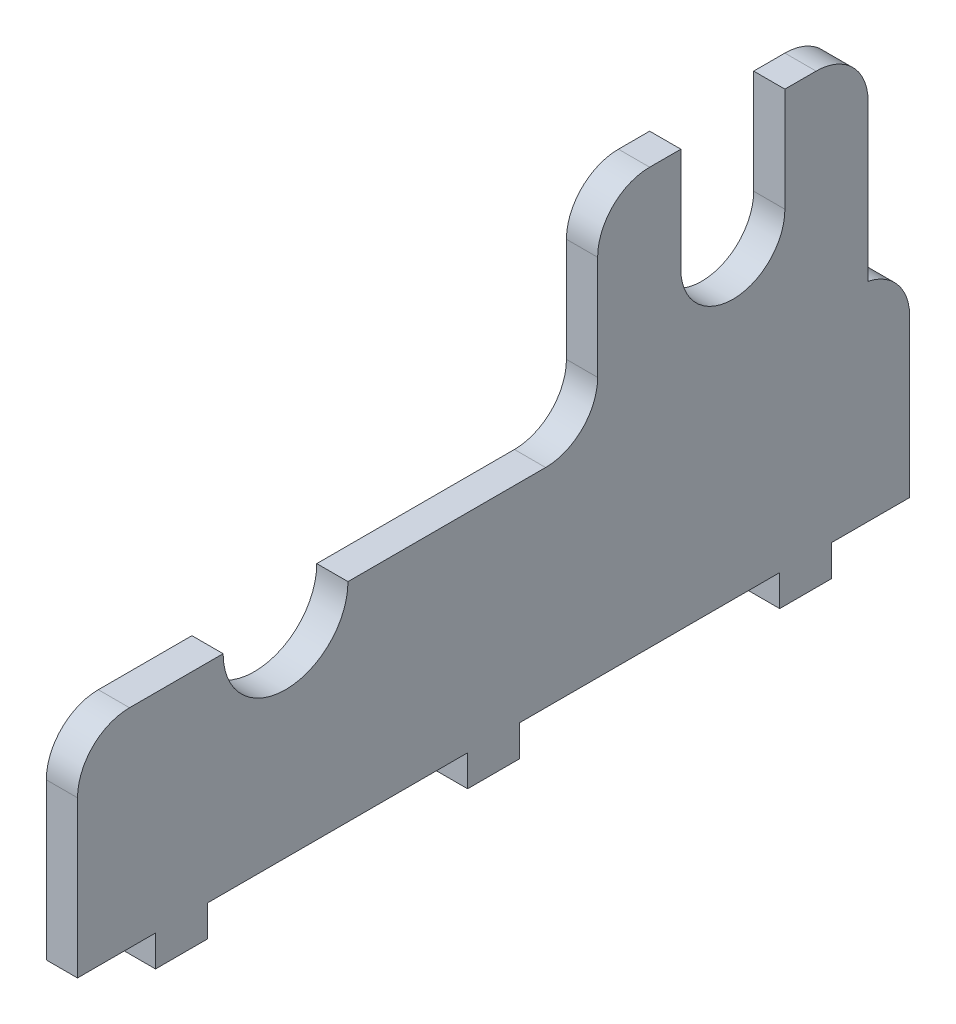
ISO-10303-21;
HEADER;
FILE_DESCRIPTION(('STEP AP214'),'2;1');
FILE_NAME('part.step','',(''),(''),'','','');
FILE_SCHEMA(('AUTOMOTIVE_DESIGN { 1 0 10303 214 1 1 1 1 }'));
ENDSEC;
DATA;
#1=APPLICATION_CONTEXT('core data for automotive mechanical design processes');
#2=APPLICATION_PROTOCOL_DEFINITION('international standard','automotive_design',2000,#1);
#3=PRODUCT_CONTEXT('',#1,'mechanical');
#4=PRODUCT('Part','Part','',(#3));
#5=PRODUCT_RELATED_PRODUCT_CATEGORY('part','',(#4));
#6=PRODUCT_DEFINITION_FORMATION('','',#4);
#7=PRODUCT_DEFINITION_CONTEXT('part definition',#1,'design');
#8=PRODUCT_DEFINITION('design','',#6,#7);
#9=PRODUCT_DEFINITION_SHAPE('','',#8);
#10=(LENGTH_UNIT() NAMED_UNIT(*) SI_UNIT(.MILLI.,.METRE.));
#11=(NAMED_UNIT(*) PLANE_ANGLE_UNIT() SI_UNIT($,.RADIAN.));
#12=(NAMED_UNIT(*) SI_UNIT($,.STERADIAN.) SOLID_ANGLE_UNIT());
#13=UNCERTAINTY_MEASURE_WITH_UNIT(LENGTH_MEASURE(1.E-05),#10,'distance_accuracy_value','');
#14=(GEOMETRIC_REPRESENTATION_CONTEXT(3) GLOBAL_UNCERTAINTY_ASSIGNED_CONTEXT((#13)) GLOBAL_UNIT_ASSIGNED_CONTEXT((#10,
#11,#12)) REPRESENTATION_CONTEXT('',''));
#15=CARTESIAN_POINT('',(0.,0.,0.));
#16=DIRECTION('',(0.,0.,1.));
#17=DIRECTION('',(1.,0.,0.));
#18=AXIS2_PLACEMENT_3D('',#15,#16,#17);
#19=CARTESIAN_POINT('',(3.,0.,-50.));
#20=DIRECTION('',(0.,1.,0.));
#21=DIRECTION('',(0.,0.,1.));
#22=AXIS2_PLACEMENT_3D('',#19,#20,#21);
#23=PLANE('',#22);
#24=DIRECTION('',(1.,0.,0.));
#25=VECTOR('',#24,1.);
#26=CARTESIAN_POINT('',(0.,0.,-42.5));
#27=LINE('',#26,#25);
#28=CARTESIAN_POINT('',(0.,0.,-42.5));
#29=VERTEX_POINT('',#28);
#30=CARTESIAN_POINT('',(3.,0.,-42.5));
#31=VERTEX_POINT('',#30);
#32=EDGE_CURVE('E509',#29,#31,#27,.T.);
#33=ORIENTED_EDGE('',*,*,#32,.F.);
#34=DIRECTION('',(0.,0.,-1.));
#35=VECTOR('',#34,1.);
#36=CARTESIAN_POINT('',(0.,0.,-50.));
#37=LINE('',#36,#35);
#38=CARTESIAN_POINT('',(0.,0.,-50.));
#39=VERTEX_POINT('',#38);
#40=EDGE_CURVE('E259',#29,#39,#37,.T.);
#41=ORIENTED_EDGE('',*,*,#40,.T.);
#42=DIRECTION('',(-1.,0.,0.));
#43=VECTOR('',#42,1.);
#44=CARTESIAN_POINT('',(3.,0.,-50.));
#45=LINE('',#44,#43);
#46=CARTESIAN_POINT('',(3.,0.,-50.));
#47=VERTEX_POINT('',#46);
#48=EDGE_CURVE('E398',#47,#39,#45,.T.);
#49=ORIENTED_EDGE('',*,*,#48,.F.);
#50=DIRECTION('',(0.,0.,-1.));
#51=VECTOR('',#50,1.);
#52=CARTESIAN_POINT('',(3.,0.,-50.));
#53=LINE('',#52,#51);
#54=EDGE_CURVE('E54',#31,#47,#53,.T.);
#55=ORIENTED_EDGE('',*,*,#54,.F.);
#56=EDGE_LOOP('',(#33,#41,#49,#55));
#57=FACE_BOUND('',#56,.T.);
#58=ADVANCED_FACE('F39',(#57),#23,.F.);
#59=DIRECTION('',(-1.,0.,0.));
#60=VECTOR('',#59,1.);
#61=CARTESIAN_POINT('',(0.,0.,-37.5));
#62=LINE('',#61,#60);
#63=CARTESIAN_POINT('',(3.,0.,-37.5));
#64=VERTEX_POINT('',#63);
#65=CARTESIAN_POINT('',(0.,0.,-37.5));
#66=VERTEX_POINT('',#65);
#67=EDGE_CURVE('E62',#64,#66,#62,.T.);
#68=ORIENTED_EDGE('',*,*,#67,.F.);
#69=CARTESIAN_POINT('',(3.,0.,-12.5));
#70=VERTEX_POINT('',#69);
#71=EDGE_CURVE('E828',#70,#64,#53,.T.);
#72=ORIENTED_EDGE('',*,*,#71,.F.);
#73=DIRECTION('',(1.,0.,0.));
#74=VECTOR('',#73,1.);
#75=CARTESIAN_POINT('',(0.,0.,-12.5));
#76=LINE('',#75,#74);
#77=CARTESIAN_POINT('',(0.,0.,-12.5));
#78=VERTEX_POINT('',#77);
#79=EDGE_CURVE('E260',#78,#70,#76,.T.);
#80=ORIENTED_EDGE('',*,*,#79,.F.);
#81=EDGE_CURVE('E506',#78,#66,#37,.T.);
#82=ORIENTED_EDGE('',*,*,#81,.T.);
#83=EDGE_LOOP('',(#68,#72,#80,#82));
#84=FACE_BOUND('',#83,.T.);
#85=ADVANCED_FACE('F556',(#84),#23,.F.);
#86=DIRECTION('',(-1.,0.,0.));
#87=VECTOR('',#86,1.);
#88=CARTESIAN_POINT('',(0.,0.,-7.5));
#89=LINE('',#88,#87);
#90=CARTESIAN_POINT('',(3.,0.,-7.5));
#91=VERTEX_POINT('',#90);
#92=CARTESIAN_POINT('',(0.,0.,-7.5));
#93=VERTEX_POINT('',#92);
#94=EDGE_CURVE('E263',#91,#93,#89,.T.);
#95=ORIENTED_EDGE('',*,*,#94,.F.);
#96=CARTESIAN_POINT('',(3.,0.,17.5));
#97=VERTEX_POINT('',#96);
#98=EDGE_CURVE('E381',#97,#91,#53,.T.);
#99=ORIENTED_EDGE('',*,*,#98,.F.);
#100=DIRECTION('',(1.,0.,0.));
#101=VECTOR('',#100,1.);
#102=CARTESIAN_POINT('',(0.,0.,17.5));
#103=LINE('',#102,#101);
#104=CARTESIAN_POINT('',(0.,0.,17.5));
#105=VERTEX_POINT('',#104);
#106=EDGE_CURVE('E292',#105,#97,#103,.T.);
#107=ORIENTED_EDGE('',*,*,#106,.F.);
#108=EDGE_CURVE('E392',#105,#93,#37,.T.);
#109=ORIENTED_EDGE('',*,*,#108,.T.);
#110=EDGE_LOOP('',(#95,#99,#107,#109));
#111=FACE_BOUND('',#110,.T.);
#112=ADVANCED_FACE('F503',(#111),#23,.F.);
#113=DIRECTION('',(-1.,0.,0.));
#114=VECTOR('',#113,1.);
#115=CARTESIAN_POINT('',(0.,0.,22.5));
#116=LINE('',#115,#114);
#117=CARTESIAN_POINT('',(3.,0.,22.5));
#118=VERTEX_POINT('',#117);
#119=CARTESIAN_POINT('',(0.,0.,22.5));
#120=VERTEX_POINT('',#119);
#121=EDGE_CURVE('E297',#118,#120,#116,.T.);
#122=ORIENTED_EDGE('',*,*,#121,.F.);
#123=CARTESIAN_POINT('',(3.,0.,30.));
#124=VERTEX_POINT('',#123);
#125=EDGE_CURVE('E377',#124,#118,#53,.T.);
#126=ORIENTED_EDGE('',*,*,#125,.F.);
#127=DIRECTION('',(-1.,0.,0.));
#128=VECTOR('',#127,1.);
#129=CARTESIAN_POINT('',(3.,0.,30.));
#130=LINE('',#129,#128);
#131=CARTESIAN_POINT('',(0.,0.,30.));
#132=VERTEX_POINT('',#131);
#133=EDGE_CURVE('E401',#124,#132,#130,.T.);
#134=ORIENTED_EDGE('',*,*,#133,.T.);
#135=EDGE_CURVE('E389',#132,#120,#37,.T.);
#136=ORIENTED_EDGE('',*,*,#135,.T.);
#137=EDGE_LOOP('',(#122,#126,#134,#136));
#138=FACE_BOUND('',#137,.T.);
#139=ADVANCED_FACE('F487',(#138),#23,.F.);
#140=CARTESIAN_POINT('',(3.,40.,-50.));
#141=DIRECTION('',(0.,-1.,0.));
#142=DIRECTION('',(0.,0.,-1.));
#143=AXIS2_PLACEMENT_3D('',#140,#141,#142);
#144=PLANE('',#143);
#145=DIRECTION('',(0.,0.,1.));
#146=VECTOR('',#145,1.);
#147=CARTESIAN_POINT('',(3.,40.,-50.));
#148=LINE('',#147,#146);
#149=CARTESIAN_POINT('',(3.,40.,-41.));
#150=VERTEX_POINT('',#149);
#151=CARTESIAN_POINT('',(3.,40.,-38.));
#152=VERTEX_POINT('',#151);
#153=EDGE_CURVE('E387',#150,#152,#148,.T.);
#154=ORIENTED_EDGE('',*,*,#153,.F.);
#155=DIRECTION('',(-1.,0.,0.));
#156=VECTOR('',#155,1.);
#157=CARTESIAN_POINT('',(3.,40.,-41.));
#158=LINE('',#157,#156);
#159=CARTESIAN_POINT('',(0.,40.,-41.));
#160=VERTEX_POINT('',#159);
#161=EDGE_CURVE('E428',#150,#160,#158,.T.);
#162=ORIENTED_EDGE('',*,*,#161,.T.);
#163=DIRECTION('',(0.,0.,1.));
#164=VECTOR('',#163,1.);
#165=CARTESIAN_POINT('',(0.,40.,-50.));
#166=LINE('',#165,#164);
#167=CARTESIAN_POINT('',(0.,40.,-38.));
#168=VERTEX_POINT('',#167);
#169=EDGE_CURVE('E376',#160,#168,#166,.T.);
#170=ORIENTED_EDGE('',*,*,#169,.T.);
#171=DIRECTION('',(-1.,0.,0.));
#172=VECTOR('',#171,1.);
#173=CARTESIAN_POINT('',(3.,40.,-38.));
#174=LINE('',#173,#172);
#175=EDGE_CURVE('E350',#152,#168,#174,.T.);
#176=ORIENTED_EDGE('',*,*,#175,.F.);
#177=EDGE_LOOP('',(#154,#162,#170,#176));
#178=FACE_BOUND('',#177,.T.);
#179=ADVANCED_FACE('F528',(#178),#144,.F.);
#180=CARTESIAN_POINT('',(3.,0.,30.));
#181=DIRECTION('',(0.,0.,-1.));
#182=DIRECTION('',(0.,1.,0.));
#183=AXIS2_PLACEMENT_3D('',#180,#181,#182);
#184=PLANE('',#183);
#185=DIRECTION('',(0.,-1.,0.));
#186=VECTOR('',#185,1.);
#187=CARTESIAN_POINT('',(3.,0.,30.));
#188=LINE('',#187,#186);
#189=CARTESIAN_POINT('',(3.,15.,30.));
#190=VERTEX_POINT('',#189);
#191=EDGE_CURVE('E374',#190,#124,#188,.T.);
#192=ORIENTED_EDGE('',*,*,#191,.F.);
#193=DIRECTION('',(-1.,0.,0.));
#194=VECTOR('',#193,1.);
#195=CARTESIAN_POINT('',(3.,15.,30.));
#196=LINE('',#195,#194);
#197=CARTESIAN_POINT('',(0.,15.,30.));
#198=VERTEX_POINT('',#197);
#199=EDGE_CURVE('E433',#190,#198,#196,.T.);
#200=ORIENTED_EDGE('',*,*,#199,.T.);
#201=DIRECTION('',(0.,-1.,0.));
#202=VECTOR('',#201,1.);
#203=CARTESIAN_POINT('',(0.,0.,30.));
#204=LINE('',#203,#202);
#205=EDGE_CURVE('E371',#198,#132,#204,.T.);
#206=ORIENTED_EDGE('',*,*,#205,.T.);
#207=ORIENTED_EDGE('',*,*,#133,.F.);
#208=EDGE_LOOP('',(#192,#200,#206,#207));
#209=FACE_BOUND('',#208,.T.);
#210=ADVANCED_FACE('F478',(#209),#184,.F.);
#211=CARTESIAN_POINT('',(3.,0.,-50.));
#212=DIRECTION('',(0.,0.,1.));
#213=DIRECTION('',(1.,0.,0.));
#214=AXIS2_PLACEMENT_3D('',#211,#212,#213);
#215=PLANE('',#214);
#216=DIRECTION('',(0.,1.,0.));
#217=VECTOR('',#216,1.);
#218=CARTESIAN_POINT('',(0.,0.,-50.));
#219=LINE('',#218,#217);
#220=CARTESIAN_POINT('',(0.,15.1010205144336,-50.));
#221=VERTEX_POINT('',#220);
#222=EDGE_CURVE('E391',#39,#221,#219,.T.);
#223=ORIENTED_EDGE('',*,*,#222,.T.);
#224=DIRECTION('',(-1.,0.,0.));
#225=VECTOR('',#224,1.);
#226=CARTESIAN_POINT('',(3.,15.1010205144336,-50.));
#227=LINE('',#226,#225);
#228=CARTESIAN_POINT('',(3.,15.1010205144336,-50.));
#229=VERTEX_POINT('',#228);
#230=EDGE_CURVE('E418',#221,#229,#227,.F.);
#231=ORIENTED_EDGE('',*,*,#230,.T.);
#232=DIRECTION('',(0.,1.,0.));
#233=VECTOR('',#232,1.);
#234=CARTESIAN_POINT('',(3.,0.,-50.));
#235=LINE('',#234,#233);
#236=EDGE_CURVE('E380',#47,#229,#235,.T.);
#237=ORIENTED_EDGE('',*,*,#236,.F.);
#238=ORIENTED_EDGE('',*,*,#48,.T.);
#239=EDGE_LOOP('',(#223,#231,#237,#238));
#240=FACE_BOUND('',#239,.T.);
#241=ADVANCED_FACE('F511',(#240),#215,.F.);
#242=CARTESIAN_POINT('',(0.,40.,-28.));
#243=VERTEX_POINT('',#242);
#244=CARTESIAN_POINT('',(0.,40.,-25.));
#245=VERTEX_POINT('',#244);
#246=EDGE_CURVE('E395',#243,#245,#166,.T.);
#247=ORIENTED_EDGE('',*,*,#246,.T.);
#248=DIRECTION('',(-1.,0.,0.));
#249=VECTOR('',#248,1.);
#250=CARTESIAN_POINT('',(3.,40.,-25.));
#251=LINE('',#250,#249);
#252=CARTESIAN_POINT('',(3.,40.,-25.));
#253=VERTEX_POINT('',#252);
#254=EDGE_CURVE('E446',#245,#253,#251,.F.);
#255=ORIENTED_EDGE('',*,*,#254,.T.);
#256=CARTESIAN_POINT('',(3.,40.,-28.));
#257=VERTEX_POINT('',#256);
#258=EDGE_CURVE('E384',#257,#253,#148,.T.);
#259=ORIENTED_EDGE('',*,*,#258,.F.);
#260=DIRECTION('',(-1.,0.,0.));
#261=VECTOR('',#260,1.);
#262=CARTESIAN_POINT('',(3.,40.,-28.));
#263=LINE('',#262,#261);
#264=EDGE_CURVE('E353',#257,#243,#263,.T.);
#265=ORIENTED_EDGE('',*,*,#264,.T.);
#266=EDGE_LOOP('',(#247,#255,#259,#265));
#267=FACE_BOUND('',#266,.T.);
#268=ADVANCED_FACE('F545',(#267),#144,.F.);
#269=CARTESIAN_POINT('',(3.,0.,0.));
#270=DIRECTION('',(1.,0.,0.));
#271=DIRECTION('',(0.,0.,-1.));
#272=AXIS2_PLACEMENT_3D('',#269,#270,#271);
#273=PLANE('',#272);
#274=ORIENTED_EDGE('',*,*,#236,.T.);
#275=CARTESIAN_POINT('',(3.,15.1010205144336,-45.));
#276=DIRECTION('',(1.,0.,0.));
#277=DIRECTION('',(0.,0.,-1.));
#278=AXIS2_PLACEMENT_3D('',#275,#276,#277);
#279=CIRCLE('',#278,5.);
#280=CARTESIAN_POINT('',(3.,20.,-46.));
#281=VERTEX_POINT('',#280);
#282=EDGE_CURVE('E426',#229,#281,#279,.T.);
#283=ORIENTED_EDGE('',*,*,#282,.T.);
#284=DIRECTION('',(0.,1.,0.));
#285=VECTOR('',#284,1.);
#286=CARTESIAN_POINT('',(3.,40.,-46.));
#287=LINE('',#286,#285);
#288=CARTESIAN_POINT('',(3.,35.,-46.));
#289=VERTEX_POINT('',#288);
#290=EDGE_CURVE('E320',#281,#289,#287,.T.);
#291=ORIENTED_EDGE('',*,*,#290,.T.);
#292=CARTESIAN_POINT('',(3.,35.,-41.));
#293=DIRECTION('',(1.,0.,0.));
#294=DIRECTION('',(0.,0.,-1.));
#295=AXIS2_PLACEMENT_3D('',#292,#293,#294);
#296=CIRCLE('',#295,5.);
#297=EDGE_CURVE('E424',#289,#150,#296,.T.);
#298=ORIENTED_EDGE('',*,*,#297,.T.);
#299=ORIENTED_EDGE('',*,*,#153,.T.);
#300=DIRECTION('',(0.,-1.,0.));
#301=VECTOR('',#300,1.);
#302=CARTESIAN_POINT('',(3.,30.,-38.));
#303=LINE('',#302,#301);
#304=CARTESIAN_POINT('',(3.,30.,-38.));
#305=VERTEX_POINT('',#304);
#306=EDGE_CURVE('E338',#152,#305,#303,.T.);
#307=ORIENTED_EDGE('',*,*,#306,.T.);
#308=CARTESIAN_POINT('',(3.,30.,-33.));
#309=DIRECTION('',(-1.,0.,0.));
#310=DIRECTION('',(0.,0.,1.));
#311=AXIS2_PLACEMENT_3D('',#308,#309,#310);
#312=CIRCLE('',#311,5.);
#313=CARTESIAN_POINT('',(3.,30.,-28.));
#314=VERTEX_POINT('',#313);
#315=EDGE_CURVE('E331',#305,#314,#312,.T.);
#316=ORIENTED_EDGE('',*,*,#315,.T.);
#317=DIRECTION('',(0.,1.,0.));
#318=VECTOR('',#317,1.);
#319=CARTESIAN_POINT('',(3.,30.,-28.));
#320=LINE('',#319,#318);
#321=EDGE_CURVE('E334',#314,#257,#320,.T.);
#322=ORIENTED_EDGE('',*,*,#321,.T.);
#323=ORIENTED_EDGE('',*,*,#258,.T.);
#324=CARTESIAN_POINT('',(3.,35.,-25.));
#325=DIRECTION('',(1.,0.,0.));
#326=DIRECTION('',(0.,0.,-1.));
#327=AXIS2_PLACEMENT_3D('',#324,#325,#326);
#328=CIRCLE('',#327,5.);
#329=CARTESIAN_POINT('',(3.,35.,-20.));
#330=VERTEX_POINT('',#329);
#331=EDGE_CURVE('E420',#253,#330,#328,.T.);
#332=ORIENTED_EDGE('',*,*,#331,.T.);
#333=DIRECTION('',(0.,-1.,0.));
#334=VECTOR('',#333,1.);
#335=CARTESIAN_POINT('',(3.,40.,-20.));
#336=LINE('',#335,#334);
#337=CARTESIAN_POINT('',(3.,25.,-20.));
#338=VERTEX_POINT('',#337);
#339=EDGE_CURVE('E358',#330,#338,#336,.T.);
#340=ORIENTED_EDGE('',*,*,#339,.T.);
#341=CARTESIAN_POINT('',(3.,25.,-15.));
#342=DIRECTION('',(1.,0.,0.));
#343=DIRECTION('',(0.,0.,-1.));
#344=AXIS2_PLACEMENT_3D('',#341,#342,#343);
#345=CIRCLE('',#344,5.);
#346=CARTESIAN_POINT('',(3.,20.,-15.));
#347=VERTEX_POINT('',#346);
#348=EDGE_CURVE('E11',#338,#347,#345,.F.);
#349=ORIENTED_EDGE('',*,*,#348,.T.);
#350=DIRECTION('',(0.,0.,1.));
#351=VECTOR('',#350,1.);
#352=CARTESIAN_POINT('',(3.,20.,-20.));
#353=LINE('',#352,#351);
#354=CARTESIAN_POINT('',(3.,20.,4.00000000000001));
#355=VERTEX_POINT('',#354);
#356=EDGE_CURVE('E345',#347,#355,#353,.T.);
#357=ORIENTED_EDGE('',*,*,#356,.T.);
#358=CARTESIAN_POINT('',(3.,20.,10.));
#359=DIRECTION('',(1.,0.,0.));
#360=DIRECTION('',(0.,0.,-1.));
#361=AXIS2_PLACEMENT_3D('',#358,#359,#360);
#362=CIRCLE('',#361,6.);
#363=CARTESIAN_POINT('',(3.,20.,16.));
#364=VERTEX_POINT('',#363);
#365=EDGE_CURVE('E330',#364,#355,#362,.T.);
#366=ORIENTED_EDGE('',*,*,#365,.F.);
#367=CARTESIAN_POINT('',(3.,20.,25.));
#368=VERTEX_POINT('',#367);
#369=EDGE_CURVE('E361',#364,#368,#353,.T.);
#370=ORIENTED_EDGE('',*,*,#369,.T.);
#371=CARTESIAN_POINT('',(3.,15.,25.));
#372=DIRECTION('',(1.,0.,0.));
#373=DIRECTION('',(0.,0.,-1.));
#374=AXIS2_PLACEMENT_3D('',#371,#372,#373);
#375=CIRCLE('',#374,5.);
#376=EDGE_CURVE('E422',#368,#190,#375,.T.);
#377=ORIENTED_EDGE('',*,*,#376,.T.);
#378=ORIENTED_EDGE('',*,*,#191,.T.);
#379=ORIENTED_EDGE('',*,*,#125,.T.);
#380=DIRECTION('',(0.,1.,0.));
#381=VECTOR('',#380,1.);
#382=CARTESIAN_POINT('',(3.,-3.,22.5));
#383=LINE('',#382,#381);
#384=CARTESIAN_POINT('',(3.,-3.,22.5));
#385=VERTEX_POINT('',#384);
#386=EDGE_CURVE('E310',#385,#118,#383,.T.);
#387=ORIENTED_EDGE('',*,*,#386,.F.);
#388=DIRECTION('',(0.,0.,1.));
#389=VECTOR('',#388,1.);
#390=CARTESIAN_POINT('',(3.,-3.,22.5));
#391=LINE('',#390,#389);
#392=CARTESIAN_POINT('',(3.,-3.,17.5));
#393=VERTEX_POINT('',#392);
#394=EDGE_CURVE('E299',#393,#385,#391,.T.);
#395=ORIENTED_EDGE('',*,*,#394,.F.);
#396=DIRECTION('',(0.,1.,0.));
#397=VECTOR('',#396,1.);
#398=CARTESIAN_POINT('',(3.,-3.,17.5));
#399=LINE('',#398,#397);
#400=EDGE_CURVE('E313',#393,#97,#399,.T.);
#401=ORIENTED_EDGE('',*,*,#400,.T.);
#402=ORIENTED_EDGE('',*,*,#98,.T.);
#403=DIRECTION('',(0.,1.,0.));
#404=VECTOR('',#403,1.);
#405=CARTESIAN_POINT('',(3.,-3.,-7.5));
#406=LINE('',#405,#404);
#407=CARTESIAN_POINT('',(3.,-3.,-7.5));
#408=VERTEX_POINT('',#407);
#409=EDGE_CURVE('E283',#408,#91,#406,.T.);
#410=ORIENTED_EDGE('',*,*,#409,.F.);
#411=DIRECTION('',(0.,0.,1.));
#412=VECTOR('',#411,1.);
#413=CARTESIAN_POINT('',(3.,-3.,-7.5));
#414=LINE('',#413,#412);
#415=CARTESIAN_POINT('',(3.,-3.,-12.5));
#416=VERTEX_POINT('',#415);
#417=EDGE_CURVE('E274',#416,#408,#414,.T.);
#418=ORIENTED_EDGE('',*,*,#417,.F.);
#419=DIRECTION('',(0.,1.,0.));
#420=VECTOR('',#419,1.);
#421=CARTESIAN_POINT('',(3.,-3.,-12.5));
#422=LINE('',#421,#420);
#423=EDGE_CURVE('E286',#416,#70,#422,.T.);
#424=ORIENTED_EDGE('',*,*,#423,.T.);
#425=ORIENTED_EDGE('',*,*,#71,.T.);
#426=DIRECTION('',(0.,1.,0.));
#427=VECTOR('',#426,1.);
#428=CARTESIAN_POINT('',(3.,-3.,-37.5));
#429=LINE('',#428,#427);
#430=CARTESIAN_POINT('',(3.,-3.,-37.5));
#431=VERTEX_POINT('',#430);
#432=EDGE_CURVE('E265',#431,#64,#429,.T.);
#433=ORIENTED_EDGE('',*,*,#432,.F.);
#434=DIRECTION('',(0.,0.,1.));
#435=VECTOR('',#434,1.);
#436=CARTESIAN_POINT('',(3.,-3.,-37.5));
#437=LINE('',#436,#435);
#438=CARTESIAN_POINT('',(3.,-3.,-42.5));
#439=VERTEX_POINT('',#438);
#440=EDGE_CURVE('E245',#439,#431,#437,.T.);
#441=ORIENTED_EDGE('',*,*,#440,.F.);
#442=DIRECTION('',(0.,1.,0.));
#443=VECTOR('',#442,1.);
#444=CARTESIAN_POINT('',(3.,-3.,-42.5));
#445=LINE('',#444,#443);
#446=EDGE_CURVE('E242',#439,#31,#445,.T.);
#447=ORIENTED_EDGE('',*,*,#446,.T.);
#448=ORIENTED_EDGE('',*,*,#54,.T.);
#449=EDGE_LOOP('',(#274,#283,#291,#298,#299,#307,#316,#322,#323,#332,#340,#349,#357,#366,#370,
#377,#378,#379,#387,#395,#401,#402,#410,#418,#424,#425,#433,#441,#447,#448));
#450=FACE_BOUND('',#449,.T.);
#451=ADVANCED_FACE('F460',(#450),#273,.T.);
#452=CARTESIAN_POINT('',(0.,0.,0.));
#453=DIRECTION('',(1.,0.,0.));
#454=DIRECTION('',(0.,0.,-1.));
#455=AXIS2_PLACEMENT_3D('',#452,#453,#454);
#456=PLANE('',#455);
#457=DIRECTION('',(0.,1.,0.));
#458=VECTOR('',#457,1.);
#459=CARTESIAN_POINT('',(0.,40.,-46.));
#460=LINE('',#459,#458);
#461=CARTESIAN_POINT('',(0.,20.,-46.));
#462=VERTEX_POINT('',#461);
#463=CARTESIAN_POINT('',(0.,35.,-46.));
#464=VERTEX_POINT('',#463);
#465=EDGE_CURVE('E324',#462,#464,#460,.T.);
#466=ORIENTED_EDGE('',*,*,#465,.F.);
#467=CARTESIAN_POINT('',(0.,15.1010205144336,-45.));
#468=DIRECTION('',(1.,0.,0.));
#469=DIRECTION('',(0.,0.,-1.));
#470=AXIS2_PLACEMENT_3D('',#467,#468,#469);
#471=CIRCLE('',#470,5.);
#472=EDGE_CURVE('E416',#462,#221,#471,.F.);
#473=ORIENTED_EDGE('',*,*,#472,.T.);
#474=ORIENTED_EDGE('',*,*,#222,.F.);
#475=ORIENTED_EDGE('',*,*,#40,.F.);
#476=DIRECTION('',(0.,1.,0.));
#477=VECTOR('',#476,1.);
#478=CARTESIAN_POINT('',(0.,-3.,-42.5));
#479=LINE('',#478,#477);
#480=CARTESIAN_POINT('',(0.,-3.,-42.5));
#481=VERTEX_POINT('',#480);
#482=EDGE_CURVE('E240',#481,#29,#479,.T.);
#483=ORIENTED_EDGE('',*,*,#482,.F.);
#484=DIRECTION('',(0.,0.,-1.));
#485=VECTOR('',#484,1.);
#486=CARTESIAN_POINT('',(0.,-3.,-37.5));
#487=LINE('',#486,#485);
#488=CARTESIAN_POINT('',(0.,-3.,-37.5));
#489=VERTEX_POINT('',#488);
#490=EDGE_CURVE('E246',#489,#481,#487,.T.);
#491=ORIENTED_EDGE('',*,*,#490,.F.);
#492=DIRECTION('',(0.,1.,0.));
#493=VECTOR('',#492,1.);
#494=CARTESIAN_POINT('',(0.,-3.,-37.5));
#495=LINE('',#494,#493);
#496=EDGE_CURVE('E820',#489,#66,#495,.T.);
#497=ORIENTED_EDGE('',*,*,#496,.T.);
#498=ORIENTED_EDGE('',*,*,#81,.F.);
#499=DIRECTION('',(0.,1.,0.));
#500=VECTOR('',#499,1.);
#501=CARTESIAN_POINT('',(0.,-3.,-12.5));
#502=LINE('',#501,#500);
#503=CARTESIAN_POINT('',(0.,-3.,-12.5));
#504=VERTEX_POINT('',#503);
#505=EDGE_CURVE('E289',#504,#78,#502,.T.);
#506=ORIENTED_EDGE('',*,*,#505,.F.);
#507=DIRECTION('',(0.,0.,-1.));
#508=VECTOR('',#507,1.);
#509=CARTESIAN_POINT('',(0.,-3.,-7.5));
#510=LINE('',#509,#508);
#511=CARTESIAN_POINT('',(0.,-3.,-7.5));
#512=VERTEX_POINT('',#511);
#513=EDGE_CURVE('E269',#512,#504,#510,.T.);
#514=ORIENTED_EDGE('',*,*,#513,.F.);
#515=DIRECTION('',(0.,1.,0.));
#516=VECTOR('',#515,1.);
#517=CARTESIAN_POINT('',(0.,-3.,-7.5));
#518=LINE('',#517,#516);
#519=EDGE_CURVE('E277',#512,#93,#518,.T.);
#520=ORIENTED_EDGE('',*,*,#519,.T.);
#521=ORIENTED_EDGE('',*,*,#108,.F.);
#522=DIRECTION('',(0.,1.,0.));
#523=VECTOR('',#522,1.);
#524=CARTESIAN_POINT('',(0.,-3.,17.5));
#525=LINE('',#524,#523);
#526=CARTESIAN_POINT('',(0.,-3.,17.5));
#527=VERTEX_POINT('',#526);
#528=EDGE_CURVE('E316',#527,#105,#525,.T.);
#529=ORIENTED_EDGE('',*,*,#528,.F.);
#530=DIRECTION('',(0.,0.,-1.));
#531=VECTOR('',#530,1.);
#532=CARTESIAN_POINT('',(0.,-3.,22.5));
#533=LINE('',#532,#531);
#534=CARTESIAN_POINT('',(0.,-3.,22.5));
#535=VERTEX_POINT('',#534);
#536=EDGE_CURVE('E293',#535,#527,#533,.T.);
#537=ORIENTED_EDGE('',*,*,#536,.F.);
#538=DIRECTION('',(0.,1.,0.));
#539=VECTOR('',#538,1.);
#540=CARTESIAN_POINT('',(0.,-3.,22.5));
#541=LINE('',#540,#539);
#542=EDGE_CURVE('E303',#535,#120,#541,.T.);
#543=ORIENTED_EDGE('',*,*,#542,.T.);
#544=ORIENTED_EDGE('',*,*,#135,.F.);
#545=ORIENTED_EDGE('',*,*,#205,.F.);
#546=CARTESIAN_POINT('',(0.,15.,25.));
#547=DIRECTION('',(1.,0.,0.));
#548=DIRECTION('',(0.,0.,-1.));
#549=AXIS2_PLACEMENT_3D('',#546,#547,#548);
#550=CIRCLE('',#549,5.);
#551=CARTESIAN_POINT('',(0.,20.,25.));
#552=VERTEX_POINT('',#551);
#553=EDGE_CURVE('E412',#198,#552,#550,.F.);
#554=ORIENTED_EDGE('',*,*,#553,.T.);
#555=DIRECTION('',(0.,0.,1.));
#556=VECTOR('',#555,1.);
#557=CARTESIAN_POINT('',(0.,20.,-20.));
#558=LINE('',#557,#556);
#559=CARTESIAN_POINT('',(0.,20.,16.));
#560=VERTEX_POINT('',#559);
#561=EDGE_CURVE('E366',#560,#552,#558,.T.);
#562=ORIENTED_EDGE('',*,*,#561,.F.);
#563=CARTESIAN_POINT('',(0.,20.,10.));
#564=DIRECTION('',(1.,0.,0.));
#565=DIRECTION('',(0.,0.,-1.));
#566=AXIS2_PLACEMENT_3D('',#563,#564,#565);
#567=CIRCLE('',#566,6.);
#568=CARTESIAN_POINT('',(0.,20.,4.00000000000001));
#569=VERTEX_POINT('',#568);
#570=EDGE_CURVE('E368',#560,#569,#567,.T.);
#571=ORIENTED_EDGE('',*,*,#570,.T.);
#572=CARTESIAN_POINT('',(0.,20.,-15.));
#573=VERTEX_POINT('',#572);
#574=EDGE_CURVE('E362',#573,#569,#558,.T.);
#575=ORIENTED_EDGE('',*,*,#574,.F.);
#576=CARTESIAN_POINT('',(0.,25.,-15.));
#577=DIRECTION('',(1.,0.,0.));
#578=DIRECTION('',(0.,0.,-1.));
#579=AXIS2_PLACEMENT_3D('',#576,#577,#578);
#580=CIRCLE('',#579,5.);
#581=CARTESIAN_POINT('',(0.,25.,-20.));
#582=VERTEX_POINT('',#581);
#583=EDGE_CURVE('E47',#573,#582,#580,.T.);
#584=ORIENTED_EDGE('',*,*,#583,.T.);
#585=DIRECTION('',(0.,-1.,0.));
#586=VECTOR('',#585,1.);
#587=CARTESIAN_POINT('',(0.,40.,-20.));
#588=LINE('',#587,#586);
#589=CARTESIAN_POINT('',(0.,35.,-20.));
#590=VERTEX_POINT('',#589);
#591=EDGE_CURVE('E319',#590,#582,#588,.T.);
#592=ORIENTED_EDGE('',*,*,#591,.F.);
#593=CARTESIAN_POINT('',(0.,35.,-25.));
#594=DIRECTION('',(1.,0.,0.));
#595=DIRECTION('',(0.,0.,-1.));
#596=AXIS2_PLACEMENT_3D('',#593,#594,#595);
#597=CIRCLE('',#596,5.);
#598=EDGE_CURVE('E410',#590,#245,#597,.F.);
#599=ORIENTED_EDGE('',*,*,#598,.T.);
#600=ORIENTED_EDGE('',*,*,#246,.F.);
#601=DIRECTION('',(0.,1.,0.));
#602=VECTOR('',#601,1.);
#603=CARTESIAN_POINT('',(0.,30.,-28.));
#604=LINE('',#603,#602);
#605=CARTESIAN_POINT('',(0.,30.,-28.));
#606=VERTEX_POINT('',#605);
#607=EDGE_CURVE('E344',#606,#243,#604,.T.);
#608=ORIENTED_EDGE('',*,*,#607,.F.);
#609=CARTESIAN_POINT('',(0.,30.,-33.));
#610=DIRECTION('',(-1.,0.,0.));
#611=DIRECTION('',(0.,0.,1.));
#612=AXIS2_PLACEMENT_3D('',#609,#610,#611);
#613=CIRCLE('',#612,5.);
#614=CARTESIAN_POINT('',(0.,30.,-38.));
#615=VERTEX_POINT('',#614);
#616=EDGE_CURVE('E342',#615,#606,#613,.T.);
#617=ORIENTED_EDGE('',*,*,#616,.F.);
#618=DIRECTION('',(0.,-1.,0.));
#619=VECTOR('',#618,1.);
#620=CARTESIAN_POINT('',(0.,30.,-38.));
#621=LINE('',#620,#619);
#622=EDGE_CURVE('E335',#168,#615,#621,.T.);
#623=ORIENTED_EDGE('',*,*,#622,.F.);
#624=ORIENTED_EDGE('',*,*,#169,.F.);
#625=CARTESIAN_POINT('',(0.,35.,-41.));
#626=DIRECTION('',(1.,0.,0.));
#627=DIRECTION('',(0.,0.,-1.));
#628=AXIS2_PLACEMENT_3D('',#625,#626,#627);
#629=CIRCLE('',#628,5.);
#630=EDGE_CURVE('E414',#160,#464,#629,.F.);
#631=ORIENTED_EDGE('',*,*,#630,.T.);
#632=EDGE_LOOP('',(#466,#473,#474,#475,#483,#491,#497,#498,#506,#514,#520,#521,#529,#537,#543,
#544,#545,#554,#562,#571,#575,#584,#592,#599,#600,#608,#617,#623,#624,#631));
#633=FACE_BOUND('',#632,.T.);
#634=ADVANCED_FACE('F257',(#633),#456,.F.);
#635=CARTESIAN_POINT('',(0.,20.,10.));
#636=DIRECTION('',(1.,0.,0.));
#637=DIRECTION('',(0.,0.,-1.));
#638=AXIS2_PLACEMENT_3D('',#635,#636,#637);
#639=CYLINDRICAL_SURFACE('',#638,6.);
#640=ORIENTED_EDGE('',*,*,#365,.T.);
#641=DIRECTION('',(1.,0.,0.));
#642=VECTOR('',#641,1.);
#643=CARTESIAN_POINT('',(0.,20.,4.00000000000001));
#644=LINE('',#643,#642);
#645=EDGE_CURVE('E407',#355,#569,#644,.F.);
#646=ORIENTED_EDGE('',*,*,#645,.T.);
#647=ORIENTED_EDGE('',*,*,#570,.F.);
#648=DIRECTION('',(1.,0.,0.));
#649=VECTOR('',#648,1.);
#650=CARTESIAN_POINT('',(0.,20.,16.));
#651=LINE('',#650,#649);
#652=EDGE_CURVE('E404',#560,#364,#651,.T.);
#653=ORIENTED_EDGE('',*,*,#652,.T.);
#654=EDGE_LOOP('',(#640,#646,#647,#653));
#655=FACE_BOUND('',#654,.T.);
#656=ADVANCED_FACE('F467',(#655),#639,.F.);
#657=CARTESIAN_POINT('',(3.,20.,-20.));
#658=DIRECTION('',(0.,-1.,0.));
#659=DIRECTION('',(0.,0.,-1.));
#660=AXIS2_PLACEMENT_3D('',#657,#658,#659);
#661=PLANE('',#660);
#662=ORIENTED_EDGE('',*,*,#561,.T.);
#663=DIRECTION('',(-1.,0.,0.));
#664=VECTOR('',#663,1.);
#665=CARTESIAN_POINT('',(3.,20.,25.));
#666=LINE('',#665,#664);
#667=EDGE_CURVE('E436',#552,#368,#666,.F.);
#668=ORIENTED_EDGE('',*,*,#667,.T.);
#669=ORIENTED_EDGE('',*,*,#369,.F.);
#670=ORIENTED_EDGE('',*,*,#652,.F.);
#671=EDGE_LOOP('',(#662,#668,#669,#670));
#672=FACE_BOUND('',#671,.T.);
#673=ADVANCED_FACE('F674',(#672),#661,.F.);
#674=ORIENTED_EDGE('',*,*,#356,.F.);
#675=DIRECTION('',(-1.,0.,0.));
#676=VECTOR('',#675,1.);
#677=CARTESIAN_POINT('',(0.,20.,-15.));
#678=LINE('',#677,#676);
#679=EDGE_CURVE('E438',#347,#573,#678,.T.);
#680=ORIENTED_EDGE('',*,*,#679,.T.);
#681=ORIENTED_EDGE('',*,*,#574,.T.);
#682=ORIENTED_EDGE('',*,*,#645,.F.);
#683=EDGE_LOOP('',(#674,#680,#681,#682));
#684=FACE_BOUND('',#683,.T.);
#685=ADVANCED_FACE('F464',(#684),#661,.F.);
#686=CARTESIAN_POINT('',(3.,40.,-20.));
#687=DIRECTION('',(0.,0.,-1.));
#688=DIRECTION('',(0.,1.,0.));
#689=AXIS2_PLACEMENT_3D('',#686,#687,#688);
#690=PLANE('',#689);
#691=ORIENTED_EDGE('',*,*,#591,.T.);
#692=DIRECTION('',(-1.,0.,0.));
#693=VECTOR('',#692,1.);
#694=CARTESIAN_POINT('',(3.,25.,-20.));
#695=LINE('',#694,#693);
#696=EDGE_CURVE('E444',#582,#338,#695,.F.);
#697=ORIENTED_EDGE('',*,*,#696,.T.);
#698=ORIENTED_EDGE('',*,*,#339,.F.);
#699=DIRECTION('',(-1.,0.,0.));
#700=VECTOR('',#699,1.);
#701=CARTESIAN_POINT('',(3.,35.,-20.));
#702=LINE('',#701,#700);
#703=EDGE_CURVE('E441',#330,#590,#702,.T.);
#704=ORIENTED_EDGE('',*,*,#703,.T.);
#705=EDGE_LOOP('',(#691,#697,#698,#704));
#706=FACE_BOUND('',#705,.T.);
#707=ADVANCED_FACE('F453',(#706),#690,.F.);
#708=CARTESIAN_POINT('',(3.,30.,-33.));
#709=DIRECTION('',(-1.,0.,0.));
#710=DIRECTION('',(0.,0.,1.));
#711=AXIS2_PLACEMENT_3D('',#708,#709,#710);
#712=CYLINDRICAL_SURFACE('',#711,5.);
#713=ORIENTED_EDGE('',*,*,#616,.T.);
#714=DIRECTION('',(-1.,0.,0.));
#715=VECTOR('',#714,1.);
#716=CARTESIAN_POINT('',(3.,30.,-28.));
#717=LINE('',#716,#715);
#718=EDGE_CURVE('E341',#314,#606,#717,.T.);
#719=ORIENTED_EDGE('',*,*,#718,.F.);
#720=ORIENTED_EDGE('',*,*,#315,.F.);
#721=DIRECTION('',(-1.,0.,0.));
#722=VECTOR('',#721,1.);
#723=CARTESIAN_POINT('',(3.,30.,-38.));
#724=LINE('',#723,#722);
#725=EDGE_CURVE('E327',#305,#615,#724,.T.);
#726=ORIENTED_EDGE('',*,*,#725,.T.);
#727=EDGE_LOOP('',(#713,#719,#720,#726));
#728=FACE_BOUND('',#727,.T.);
#729=ADVANCED_FACE('F540',(#728),#712,.F.);
#730=CARTESIAN_POINT('',(3.,30.,-38.));
#731=DIRECTION('',(0.,0.,-1.));
#732=DIRECTION('',(-1.,0.,0.));
#733=AXIS2_PLACEMENT_3D('',#730,#731,#732);
#734=PLANE('',#733);
#735=ORIENTED_EDGE('',*,*,#622,.T.);
#736=ORIENTED_EDGE('',*,*,#725,.F.);
#737=ORIENTED_EDGE('',*,*,#306,.F.);
#738=ORIENTED_EDGE('',*,*,#175,.T.);
#739=EDGE_LOOP('',(#735,#736,#737,#738));
#740=FACE_BOUND('',#739,.T.);
#741=ADVANCED_FACE('F534',(#740),#734,.F.);
#742=CARTESIAN_POINT('',(3.,30.,-28.));
#743=DIRECTION('',(0.,0.,1.));
#744=DIRECTION('',(1.,0.,0.));
#745=AXIS2_PLACEMENT_3D('',#742,#743,#744);
#746=PLANE('',#745);
#747=ORIENTED_EDGE('',*,*,#607,.T.);
#748=ORIENTED_EDGE('',*,*,#264,.F.);
#749=ORIENTED_EDGE('',*,*,#321,.F.);
#750=ORIENTED_EDGE('',*,*,#718,.T.);
#751=EDGE_LOOP('',(#747,#748,#749,#750));
#752=FACE_BOUND('',#751,.T.);
#753=ADVANCED_FACE('F542',(#752),#746,.F.);
#754=CARTESIAN_POINT('',(3.,40.,-46.));
#755=DIRECTION('',(0.,0.,1.));
#756=DIRECTION('',(1.,0.,0.));
#757=AXIS2_PLACEMENT_3D('',#754,#755,#756);
#758=PLANE('',#757);
#759=ORIENTED_EDGE('',*,*,#465,.T.);
#760=DIRECTION('',(-1.,0.,0.));
#761=VECTOR('',#760,1.);
#762=CARTESIAN_POINT('',(3.,35.,-46.));
#763=LINE('',#762,#761);
#764=EDGE_CURVE('E431',#464,#289,#763,.F.);
#765=ORIENTED_EDGE('',*,*,#764,.T.);
#766=ORIENTED_EDGE('',*,*,#290,.F.);
#767=DIRECTION('',(-1.,0.,0.));
#768=VECTOR('',#767,1.);
#769=CARTESIAN_POINT('',(3.,20.,-46.));
#770=LINE('',#769,#768);
#771=EDGE_CURVE('E323',#281,#462,#770,.T.);
#772=ORIENTED_EDGE('',*,*,#771,.T.);
#773=EDGE_LOOP('',(#759,#765,#766,#772));
#774=FACE_BOUND('',#773,.T.);
#775=ADVANCED_FACE('F519',(#774),#758,.F.);
#776=CARTESIAN_POINT('',(3.,15.1010205144336,-45.));
#777=DIRECTION('',(-1.,0.,0.));
#778=DIRECTION('',(0.,0.,1.));
#779=AXIS2_PLACEMENT_3D('',#776,#777,#778);
#780=CYLINDRICAL_SURFACE('',#779,5.);
#781=ORIENTED_EDGE('',*,*,#282,.F.);
#782=ORIENTED_EDGE('',*,*,#230,.F.);
#783=ORIENTED_EDGE('',*,*,#472,.F.);
#784=ORIENTED_EDGE('',*,*,#771,.F.);
#785=EDGE_LOOP('',(#781,#782,#783,#784));
#786=FACE_BOUND('',#785,.T.);
#787=ADVANCED_FACE('F516',(#786),#780,.T.);
#788=CARTESIAN_POINT('',(3.,35.,-41.));
#789=DIRECTION('',(-1.,0.,0.));
#790=DIRECTION('',(0.,0.,1.));
#791=AXIS2_PLACEMENT_3D('',#788,#789,#790);
#792=CYLINDRICAL_SURFACE('',#791,5.);
#793=ORIENTED_EDGE('',*,*,#297,.F.);
#794=ORIENTED_EDGE('',*,*,#764,.F.);
#795=ORIENTED_EDGE('',*,*,#630,.F.);
#796=ORIENTED_EDGE('',*,*,#161,.F.);
#797=EDGE_LOOP('',(#793,#794,#795,#796));
#798=FACE_BOUND('',#797,.T.);
#799=ADVANCED_FACE('F525',(#798),#792,.T.);
#800=CARTESIAN_POINT('',(3.,15.,25.));
#801=DIRECTION('',(-1.,0.,0.));
#802=DIRECTION('',(0.,0.,1.));
#803=AXIS2_PLACEMENT_3D('',#800,#801,#802);
#804=CYLINDRICAL_SURFACE('',#803,5.);
#805=ORIENTED_EDGE('',*,*,#376,.F.);
#806=ORIENTED_EDGE('',*,*,#667,.F.);
#807=ORIENTED_EDGE('',*,*,#553,.F.);
#808=ORIENTED_EDGE('',*,*,#199,.F.);
#809=EDGE_LOOP('',(#805,#806,#807,#808));
#810=FACE_BOUND('',#809,.T.);
#811=ADVANCED_FACE('F475',(#810),#804,.T.);
#812=CARTESIAN_POINT('',(3.,25.,-15.));
#813=DIRECTION('',(1.,0.,0.));
#814=DIRECTION('',(0.,0.,-1.));
#815=AXIS2_PLACEMENT_3D('',#812,#813,#814);
#816=CYLINDRICAL_SURFACE('',#815,5.);
#817=ORIENTED_EDGE('',*,*,#348,.F.);
#818=ORIENTED_EDGE('',*,*,#696,.F.);
#819=ORIENTED_EDGE('',*,*,#583,.F.);
#820=ORIENTED_EDGE('',*,*,#679,.F.);
#821=EDGE_LOOP('',(#817,#818,#819,#820));
#822=FACE_BOUND('',#821,.T.);
#823=ADVANCED_FACE('F457',(#822),#816,.F.);
#824=CARTESIAN_POINT('',(3.,35.,-25.));
#825=DIRECTION('',(-1.,0.,0.));
#826=DIRECTION('',(0.,0.,1.));
#827=AXIS2_PLACEMENT_3D('',#824,#825,#826);
#828=CYLINDRICAL_SURFACE('',#827,5.);
#829=ORIENTED_EDGE('',*,*,#331,.F.);
#830=ORIENTED_EDGE('',*,*,#254,.F.);
#831=ORIENTED_EDGE('',*,*,#598,.F.);
#832=ORIENTED_EDGE('',*,*,#703,.F.);
#833=EDGE_LOOP('',(#829,#830,#831,#832));
#834=FACE_BOUND('',#833,.T.);
#835=ADVANCED_FACE('F41',(#834),#828,.T.);
#836=CARTESIAN_POINT('',(0.,-3.,17.5));
#837=DIRECTION('',(0.,0.,1.));
#838=DIRECTION('',(0.,-1.,0.));
#839=AXIS2_PLACEMENT_3D('',#836,#837,#838);
#840=PLANE('',#839);
#841=ORIENTED_EDGE('',*,*,#106,.T.);
#842=ORIENTED_EDGE('',*,*,#400,.F.);
#843=DIRECTION('',(1.,0.,0.));
#844=VECTOR('',#843,1.);
#845=CARTESIAN_POINT('',(0.,-3.,17.5));
#846=LINE('',#845,#844);
#847=EDGE_CURVE('E296',#527,#393,#846,.T.);
#848=ORIENTED_EDGE('',*,*,#847,.F.);
#849=ORIENTED_EDGE('',*,*,#528,.T.);
#850=EDGE_LOOP('',(#841,#842,#848,#849));
#851=FACE_BOUND('',#850,.T.);
#852=ADVANCED_FACE('F500',(#851),#840,.F.);
#853=CARTESIAN_POINT('',(0.,-3.,22.5));
#854=DIRECTION('',(0.,0.,-1.));
#855=DIRECTION('',(0.,1.,0.));
#856=AXIS2_PLACEMENT_3D('',#853,#854,#855);
#857=PLANE('',#856);
#858=ORIENTED_EDGE('',*,*,#121,.T.);
#859=ORIENTED_EDGE('',*,*,#542,.F.);
#860=DIRECTION('',(-1.,0.,0.));
#861=VECTOR('',#860,1.);
#862=CARTESIAN_POINT('',(0.,-3.,22.5));
#863=LINE('',#862,#861);
#864=EDGE_CURVE('E301',#385,#535,#863,.T.);
#865=ORIENTED_EDGE('',*,*,#864,.F.);
#866=ORIENTED_EDGE('',*,*,#386,.T.);
#867=EDGE_LOOP('',(#858,#859,#865,#866));
#868=FACE_BOUND('',#867,.T.);
#869=ADVANCED_FACE('F492',(#868),#857,.F.);
#870=CARTESIAN_POINT('',(0.,-3.,0.));
#871=DIRECTION('',(0.,-1.,0.));
#872=DIRECTION('',(0.,0.,-1.));
#873=AXIS2_PLACEMENT_3D('',#870,#871,#872);
#874=PLANE('',#873);
#875=ORIENTED_EDGE('',*,*,#536,.T.);
#876=ORIENTED_EDGE('',*,*,#847,.T.);
#877=ORIENTED_EDGE('',*,*,#394,.T.);
#878=ORIENTED_EDGE('',*,*,#864,.T.);
#879=EDGE_LOOP('',(#875,#876,#877,#878));
#880=FACE_BOUND('',#879,.T.);
#881=ADVANCED_FACE('F494',(#880),#874,.T.);
#882=CARTESIAN_POINT('',(0.,-3.,-12.5));
#883=DIRECTION('',(0.,0.,1.));
#884=DIRECTION('',(0.,-1.,0.));
#885=AXIS2_PLACEMENT_3D('',#882,#883,#884);
#886=PLANE('',#885);
#887=ORIENTED_EDGE('',*,*,#79,.T.);
#888=ORIENTED_EDGE('',*,*,#423,.F.);
#889=DIRECTION('',(1.,0.,0.));
#890=VECTOR('',#889,1.);
#891=CARTESIAN_POINT('',(0.,-3.,-12.5));
#892=LINE('',#891,#890);
#893=EDGE_CURVE('E272',#504,#416,#892,.T.);
#894=ORIENTED_EDGE('',*,*,#893,.F.);
#895=ORIENTED_EDGE('',*,*,#505,.T.);
#896=EDGE_LOOP('',(#887,#888,#894,#895));
#897=FACE_BOUND('',#896,.T.);
#898=ADVANCED_FACE('F590',(#897),#886,.F.);
#899=CARTESIAN_POINT('',(0.,-3.,-7.5));
#900=DIRECTION('',(0.,0.,-1.));
#901=DIRECTION('',(0.,1.,0.));
#902=AXIS2_PLACEMENT_3D('',#899,#900,#901);
#903=PLANE('',#902);
#904=ORIENTED_EDGE('',*,*,#94,.T.);
#905=ORIENTED_EDGE('',*,*,#519,.F.);
#906=DIRECTION('',(-1.,0.,0.));
#907=VECTOR('',#906,1.);
#908=CARTESIAN_POINT('',(0.,-3.,-7.5));
#909=LINE('',#908,#907);
#910=EDGE_CURVE('E276',#408,#512,#909,.T.);
#911=ORIENTED_EDGE('',*,*,#910,.F.);
#912=ORIENTED_EDGE('',*,*,#409,.T.);
#913=EDGE_LOOP('',(#904,#905,#911,#912));
#914=FACE_BOUND('',#913,.T.);
#915=ADVANCED_FACE('F770',(#914),#903,.F.);
#916=CARTESIAN_POINT('',(0.,-3.,-30.));
#917=DIRECTION('',(0.,-1.,0.));
#918=DIRECTION('',(0.,0.,-1.));
#919=AXIS2_PLACEMENT_3D('',#916,#917,#918);
#920=PLANE('',#919);
#921=ORIENTED_EDGE('',*,*,#513,.T.);
#922=ORIENTED_EDGE('',*,*,#893,.T.);
#923=ORIENTED_EDGE('',*,*,#417,.T.);
#924=ORIENTED_EDGE('',*,*,#910,.T.);
#925=EDGE_LOOP('',(#921,#922,#923,#924));
#926=FACE_BOUND('',#925,.T.);
#927=ADVANCED_FACE('F779',(#926),#920,.T.);
#928=CARTESIAN_POINT('',(0.,-3.,-42.5));
#929=DIRECTION('',(0.,0.,1.));
#930=DIRECTION('',(0.,-1.,0.));
#931=AXIS2_PLACEMENT_3D('',#928,#929,#930);
#932=PLANE('',#931);
#933=ORIENTED_EDGE('',*,*,#32,.T.);
#934=ORIENTED_EDGE('',*,*,#446,.F.);
#935=DIRECTION('',(1.,0.,0.));
#936=VECTOR('',#935,1.);
#937=CARTESIAN_POINT('',(0.,-3.,-42.5));
#938=LINE('',#937,#936);
#939=EDGE_CURVE('E236',#481,#439,#938,.T.);
#940=ORIENTED_EDGE('',*,*,#939,.F.);
#941=ORIENTED_EDGE('',*,*,#482,.T.);
#942=EDGE_LOOP('',(#933,#934,#940,#941));
#943=FACE_BOUND('',#942,.T.);
#944=ADVANCED_FACE('F238',(#943),#932,.F.);
#945=CARTESIAN_POINT('',(0.,-3.,-37.5));
#946=DIRECTION('',(0.,0.,-1.));
#947=DIRECTION('',(0.,1.,0.));
#948=AXIS2_PLACEMENT_3D('',#945,#946,#947);
#949=PLANE('',#948);
#950=ORIENTED_EDGE('',*,*,#67,.T.);
#951=ORIENTED_EDGE('',*,*,#496,.F.);
#952=DIRECTION('',(-1.,0.,0.));
#953=VECTOR('',#952,1.);
#954=CARTESIAN_POINT('',(0.,-3.,-37.5));
#955=LINE('',#954,#953);
#956=EDGE_CURVE('E251',#431,#489,#955,.T.);
#957=ORIENTED_EDGE('',*,*,#956,.F.);
#958=ORIENTED_EDGE('',*,*,#432,.T.);
#959=EDGE_LOOP('',(#950,#951,#957,#958));
#960=FACE_BOUND('',#959,.T.);
#961=ADVANCED_FACE('F796',(#960),#949,.F.);
#962=CARTESIAN_POINT('',(0.,-2.99999999999999,-60.));
#963=DIRECTION('',(0.,-1.,0.));
#964=DIRECTION('',(0.,0.,-1.));
#965=AXIS2_PLACEMENT_3D('',#962,#963,#964);
#966=PLANE('',#965);
#967=ORIENTED_EDGE('',*,*,#490,.T.);
#968=ORIENTED_EDGE('',*,*,#939,.T.);
#969=ORIENTED_EDGE('',*,*,#440,.T.);
#970=ORIENTED_EDGE('',*,*,#956,.T.);
#971=EDGE_LOOP('',(#967,#968,#969,#970));
#972=FACE_BOUND('',#971,.T.);
#973=ADVANCED_FACE('F249',(#972),#966,.T.);
#974=CLOSED_SHELL('',(#58,#85,#112,#139,#179,#210,#241,#268,#451,#634,#656,#673,#685,#707,#729,
#741,#753,#775,#787,#799,#811,#823,#835,#852,#869,#881,#898,#915,#927,#944,#961,#973));
#975=MANIFOLD_SOLID_BREP('B2',#974);
#976=ADVANCED_BREP_SHAPE_REPRESENTATION('',(#18,#975),#14);
#977=SHAPE_DEFINITION_REPRESENTATION(#9,#976);
ENDSEC;
END-ISO-10303-21;
